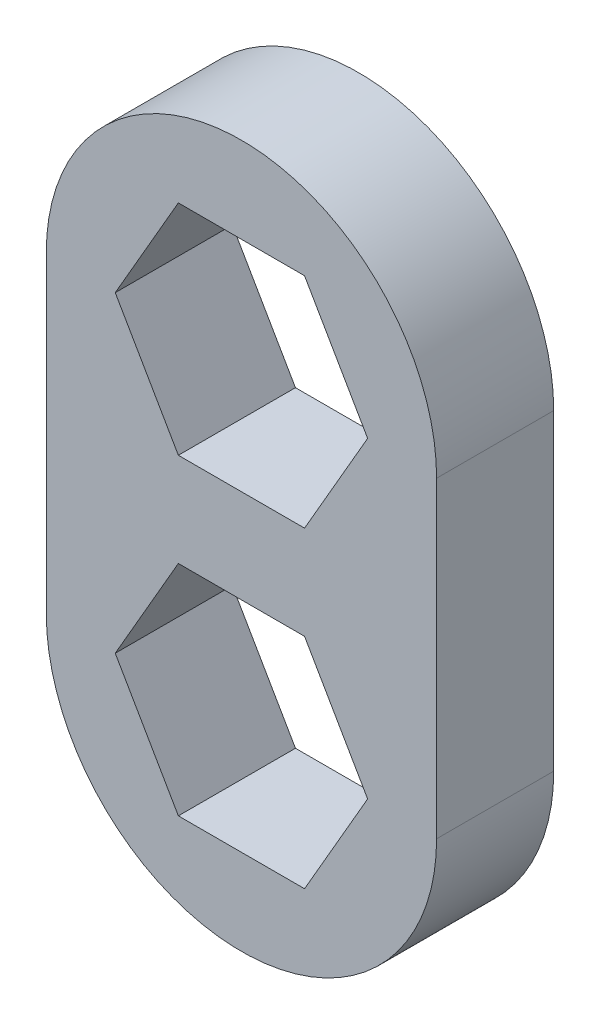
ISO-10303-21;
HEADER;
FILE_DESCRIPTION(('STEP AP214'),'2;1');
FILE_NAME('part.step','',(''),(''),'','','');
FILE_SCHEMA(('AUTOMOTIVE_DESIGN { 1 0 10303 214 1 1 1 1 }'));
ENDSEC;
DATA;
#1=APPLICATION_CONTEXT('core data for automotive mechanical design processes');
#2=APPLICATION_PROTOCOL_DEFINITION('international standard','automotive_design',2000,#1);
#3=PRODUCT_CONTEXT('',#1,'mechanical');
#4=PRODUCT('Part','Part','',(#3));
#5=PRODUCT_RELATED_PRODUCT_CATEGORY('part','',(#4));
#6=PRODUCT_DEFINITION_FORMATION('','',#4);
#7=PRODUCT_DEFINITION_CONTEXT('part definition',#1,'design');
#8=PRODUCT_DEFINITION('design','',#6,#7);
#9=PRODUCT_DEFINITION_SHAPE('','',#8);
#10=(LENGTH_UNIT() NAMED_UNIT(*) SI_UNIT(.MILLI.,.METRE.));
#11=(NAMED_UNIT(*) PLANE_ANGLE_UNIT() SI_UNIT($,.RADIAN.));
#12=(NAMED_UNIT(*) SI_UNIT($,.STERADIAN.) SOLID_ANGLE_UNIT());
#13=UNCERTAINTY_MEASURE_WITH_UNIT(LENGTH_MEASURE(1.E-05),#10,'distance_accuracy_value','');
#14=(GEOMETRIC_REPRESENTATION_CONTEXT(3) GLOBAL_UNCERTAINTY_ASSIGNED_CONTEXT((#13)) GLOBAL_UNIT_ASSIGNED_CONTEXT((#10,
#11,#12)) REPRESENTATION_CONTEXT('',''));
#15=CARTESIAN_POINT('',(0.,0.,0.));
#16=DIRECTION('',(0.,0.,1.));
#17=DIRECTION('',(1.,0.,0.));
#18=AXIS2_PLACEMENT_3D('',#15,#16,#17);
#19=CARTESIAN_POINT('',(0.,-4.,3.));
#20=DIRECTION('',(0.,0.,-1.));
#21=DIRECTION('',(-1.,0.,0.));
#22=AXIS2_PLACEMENT_3D('',#19,#20,#21);
#23=PLANE('',#22);
#24=DIRECTION('',(1.,0.,0.));
#25=VECTOR('',#24,1.);
#26=CARTESIAN_POINT('',(-1.61658075373095,1.2,3.));
#27=LINE('',#26,#25);
#28=CARTESIAN_POINT('',(-1.61658075373095,1.2,3.));
#29=VERTEX_POINT('',#28);
#30=CARTESIAN_POINT('',(1.61658075373095,1.2,3.));
#31=VERTEX_POINT('',#30);
#32=EDGE_CURVE('E226',#29,#31,#27,.T.);
#33=ORIENTED_EDGE('',*,*,#32,.F.);
#34=DIRECTION('',(0.5,-0.866025403784439,0.));
#35=VECTOR('',#34,1.);
#36=CARTESIAN_POINT('',(-3.2331615074619,4.,3.));
#37=LINE('',#36,#35);
#38=CARTESIAN_POINT('',(-3.2331615074619,4.,3.));
#39=VERTEX_POINT('',#38);
#40=EDGE_CURVE('E243',#39,#29,#37,.T.);
#41=ORIENTED_EDGE('',*,*,#40,.F.);
#42=DIRECTION('',(-0.5,-0.866025403784439,0.));
#43=VECTOR('',#42,1.);
#44=CARTESIAN_POINT('',(-1.61658075373095,6.8,3.));
#45=LINE('',#44,#43);
#46=CARTESIAN_POINT('',(-1.61658075373095,6.8,3.));
#47=VERTEX_POINT('',#46);
#48=EDGE_CURVE('E239',#47,#39,#45,.T.);
#49=ORIENTED_EDGE('',*,*,#48,.F.);
#50=DIRECTION('',(-1.,0.,0.));
#51=VECTOR('',#50,1.);
#52=CARTESIAN_POINT('',(1.61658075373095,6.8,3.));
#53=LINE('',#52,#51);
#54=CARTESIAN_POINT('',(1.61658075373095,6.8,3.));
#55=VERTEX_POINT('',#54);
#56=EDGE_CURVE('E236',#55,#47,#53,.T.);
#57=ORIENTED_EDGE('',*,*,#56,.F.);
#58=DIRECTION('',(-0.5,0.866025403784439,0.));
#59=VECTOR('',#58,1.);
#60=CARTESIAN_POINT('',(3.2331615074619,4.,3.));
#61=LINE('',#60,#59);
#62=CARTESIAN_POINT('',(3.2331615074619,4.,3.));
#63=VERTEX_POINT('',#62);
#64=EDGE_CURVE('E233',#63,#55,#61,.T.);
#65=ORIENTED_EDGE('',*,*,#64,.F.);
#66=DIRECTION('',(0.5,0.866025403784439,0.));
#67=VECTOR('',#66,1.);
#68=CARTESIAN_POINT('',(1.61658075373095,1.2,3.));
#69=LINE('',#68,#67);
#70=EDGE_CURVE('E229',#31,#63,#69,.T.);
#71=ORIENTED_EDGE('',*,*,#70,.F.);
#72=EDGE_LOOP('',(#33,#41,#49,#57,#65,#71));
#73=FACE_BOUND('',#72,.T.);
#74=CARTESIAN_POINT('',(0.,-4.,3.));
#75=DIRECTION('',(0.,0.,1.));
#76=DIRECTION('',(-1.,0.,0.));
#77=AXIS2_PLACEMENT_3D('',#74,#75,#76);
#78=CIRCLE('',#77,5.);
#79=CARTESIAN_POINT('',(-5.,-4.,3.));
#80=VERTEX_POINT('',#79);
#81=CARTESIAN_POINT('',(5.,-4.,3.));
#82=VERTEX_POINT('',#81);
#83=EDGE_CURVE('E289',#80,#82,#78,.T.);
#84=ORIENTED_EDGE('',*,*,#83,.T.);
#85=DIRECTION('',(0.,1.,0.));
#86=VECTOR('',#85,1.);
#87=CARTESIAN_POINT('',(5.,4.,3.));
#88=LINE('',#87,#86);
#89=CARTESIAN_POINT('',(5.,4.,3.));
#90=VERTEX_POINT('',#89);
#91=EDGE_CURVE('E293',#82,#90,#88,.T.);
#92=ORIENTED_EDGE('',*,*,#91,.T.);
#93=CARTESIAN_POINT('',(0.,4.,3.));
#94=DIRECTION('',(0.,0.,1.));
#95=DIRECTION('',(-1.,0.,0.));
#96=AXIS2_PLACEMENT_3D('',#93,#94,#95);
#97=CIRCLE('',#96,5.);
#98=CARTESIAN_POINT('',(-5.,4.,3.));
#99=VERTEX_POINT('',#98);
#100=EDGE_CURVE('E297',#90,#99,#97,.T.);
#101=ORIENTED_EDGE('',*,*,#100,.T.);
#102=DIRECTION('',(0.,-1.,0.));
#103=VECTOR('',#102,1.);
#104=CARTESIAN_POINT('',(-5.,-4.,3.));
#105=LINE('',#104,#103);
#106=EDGE_CURVE('E300',#99,#80,#105,.T.);
#107=ORIENTED_EDGE('',*,*,#106,.T.);
#108=EDGE_LOOP('',(#84,#92,#101,#107));
#109=FACE_BOUND('',#108,.T.);
#110=DIRECTION('',(0.5,0.866025403784439,0.));
#111=VECTOR('',#110,1.);
#112=CARTESIAN_POINT('',(1.61658075373095,-6.8,3.));
#113=LINE('',#112,#111);
#114=CARTESIAN_POINT('',(1.61658075373095,-6.8,3.));
#115=VERTEX_POINT('',#114);
#116=CARTESIAN_POINT('',(3.2331615074619,-4.,3.));
#117=VERTEX_POINT('',#116);
#118=EDGE_CURVE('E157',#115,#117,#113,.T.);
#119=ORIENTED_EDGE('',*,*,#118,.F.);
#120=DIRECTION('',(1.,0.,0.));
#121=VECTOR('',#120,1.);
#122=CARTESIAN_POINT('',(-1.61658075373095,-6.8,3.));
#123=LINE('',#122,#121);
#124=CARTESIAN_POINT('',(-1.61658075373095,-6.8,3.));
#125=VERTEX_POINT('',#124);
#126=EDGE_CURVE('E192',#125,#115,#123,.T.);
#127=ORIENTED_EDGE('',*,*,#126,.F.);
#128=DIRECTION('',(0.5,-0.866025403784438,0.));
#129=VECTOR('',#128,1.);
#130=CARTESIAN_POINT('',(-3.2331615074619,-4.,3.));
#131=LINE('',#130,#129);
#132=CARTESIAN_POINT('',(-3.2331615074619,-4.,3.));
#133=VERTEX_POINT('',#132);
#134=EDGE_CURVE('E189',#133,#125,#131,.T.);
#135=ORIENTED_EDGE('',*,*,#134,.F.);
#136=DIRECTION('',(-0.5,-0.866025403784439,0.));
#137=VECTOR('',#136,1.);
#138=CARTESIAN_POINT('',(-1.61658075373095,-1.20000000000001,3.));
#139=LINE('',#138,#137);
#140=CARTESIAN_POINT('',(-1.61658075373095,-1.20000000000001,3.));
#141=VERTEX_POINT('',#140);
#142=EDGE_CURVE('E184',#141,#133,#139,.T.);
#143=ORIENTED_EDGE('',*,*,#142,.F.);
#144=DIRECTION('',(-1.,0.,0.));
#145=VECTOR('',#144,1.);
#146=CARTESIAN_POINT('',(1.61658075373095,-1.2,3.));
#147=LINE('',#146,#145);
#148=CARTESIAN_POINT('',(1.61658075373095,-1.2,3.));
#149=VERTEX_POINT('',#148);
#150=EDGE_CURVE('E180',#149,#141,#147,.T.);
#151=ORIENTED_EDGE('',*,*,#150,.F.);
#152=DIRECTION('',(-0.499999999999999,0.866025403784439,0.));
#153=VECTOR('',#152,1.);
#154=CARTESIAN_POINT('',(3.2331615074619,-4.,3.));
#155=LINE('',#154,#153);
#156=EDGE_CURVE('E166',#117,#149,#155,.T.);
#157=ORIENTED_EDGE('',*,*,#156,.F.);
#158=EDGE_LOOP('',(#119,#127,#135,#143,#151,#157));
#159=FACE_BOUND('',#158,.T.);
#160=ADVANCED_FACE('F43',(#73,#109,#159),#23,.F.);
#161=CARTESIAN_POINT('',(0.,-4.,0.));
#162=DIRECTION('',(0.,0.,-1.));
#163=DIRECTION('',(-1.,0.,0.));
#164=AXIS2_PLACEMENT_3D('',#161,#162,#163);
#165=PLANE('',#164);
#166=CARTESIAN_POINT('',(0.,-4.,0.));
#167=DIRECTION('',(0.,0.,1.));
#168=DIRECTION('',(-1.,0.,0.));
#169=AXIS2_PLACEMENT_3D('',#166,#167,#168);
#170=CIRCLE('',#169,5.);
#171=CARTESIAN_POINT('',(-5.,-4.,0.));
#172=VERTEX_POINT('',#171);
#173=CARTESIAN_POINT('',(5.,-4.,0.));
#174=VERTEX_POINT('',#173);
#175=EDGE_CURVE('E288',#172,#174,#170,.T.);
#176=ORIENTED_EDGE('',*,*,#175,.F.);
#177=DIRECTION('',(0.,-1.,0.));
#178=VECTOR('',#177,1.);
#179=CARTESIAN_POINT('',(-5.,-4.,0.));
#180=LINE('',#179,#178);
#181=CARTESIAN_POINT('',(-5.,4.,0.));
#182=VERTEX_POINT('',#181);
#183=EDGE_CURVE('E294',#182,#172,#180,.T.);
#184=ORIENTED_EDGE('',*,*,#183,.F.);
#185=CARTESIAN_POINT('',(0.,4.,0.));
#186=DIRECTION('',(0.,0.,1.));
#187=DIRECTION('',(-1.,0.,0.));
#188=AXIS2_PLACEMENT_3D('',#185,#186,#187);
#189=CIRCLE('',#188,5.);
#190=CARTESIAN_POINT('',(5.,4.,0.));
#191=VERTEX_POINT('',#190);
#192=EDGE_CURVE('E310',#191,#182,#189,.T.);
#193=ORIENTED_EDGE('',*,*,#192,.F.);
#194=DIRECTION('',(0.,1.,0.));
#195=VECTOR('',#194,1.);
#196=CARTESIAN_POINT('',(5.,4.,0.));
#197=LINE('',#196,#195);
#198=EDGE_CURVE('E307',#174,#191,#197,.T.);
#199=ORIENTED_EDGE('',*,*,#198,.F.);
#200=EDGE_LOOP('',(#176,#184,#193,#199));
#201=FACE_BOUND('',#200,.T.);
#202=DIRECTION('',(0.5,-0.866025403784439,0.));
#203=VECTOR('',#202,1.);
#204=CARTESIAN_POINT('',(-3.2331615074619,4.,0.));
#205=LINE('',#204,#203);
#206=CARTESIAN_POINT('',(-3.2331615074619,4.,0.));
#207=VERTEX_POINT('',#206);
#208=CARTESIAN_POINT('',(-1.61658075373095,1.2,0.));
#209=VERTEX_POINT('',#208);
#210=EDGE_CURVE('E230',#207,#209,#205,.T.);
#211=ORIENTED_EDGE('',*,*,#210,.T.);
#212=DIRECTION('',(1.,0.,0.));
#213=VECTOR('',#212,1.);
#214=CARTESIAN_POINT('',(-1.61658075373095,1.2,0.));
#215=LINE('',#214,#213);
#216=CARTESIAN_POINT('',(1.61658075373095,1.2,0.));
#217=VERTEX_POINT('',#216);
#218=EDGE_CURVE('E175',#209,#217,#215,.T.);
#219=ORIENTED_EDGE('',*,*,#218,.T.);
#220=DIRECTION('',(0.5,0.866025403784439,0.));
#221=VECTOR('',#220,1.);
#222=CARTESIAN_POINT('',(1.61658075373095,1.2,0.));
#223=LINE('',#222,#221);
#224=CARTESIAN_POINT('',(3.2331615074619,4.,0.));
#225=VERTEX_POINT('',#224);
#226=EDGE_CURVE('E250',#217,#225,#223,.T.);
#227=ORIENTED_EDGE('',*,*,#226,.T.);
#228=DIRECTION('',(-0.5,0.866025403784439,0.));
#229=VECTOR('',#228,1.);
#230=CARTESIAN_POINT('',(3.2331615074619,4.,0.));
#231=LINE('',#230,#229);
#232=CARTESIAN_POINT('',(1.61658075373095,6.8,0.));
#233=VERTEX_POINT('',#232);
#234=EDGE_CURVE('E254',#225,#233,#231,.T.);
#235=ORIENTED_EDGE('',*,*,#234,.T.);
#236=DIRECTION('',(-1.,0.,0.));
#237=VECTOR('',#236,1.);
#238=CARTESIAN_POINT('',(1.61658075373095,6.8,0.));
#239=LINE('',#238,#237);
#240=CARTESIAN_POINT('',(-1.61658075373095,6.8,0.));
#241=VERTEX_POINT('',#240);
#242=EDGE_CURVE('E258',#233,#241,#239,.T.);
#243=ORIENTED_EDGE('',*,*,#242,.T.);
#244=DIRECTION('',(-0.5,-0.866025403784439,0.));
#245=VECTOR('',#244,1.);
#246=CARTESIAN_POINT('',(-1.61658075373095,6.8,0.));
#247=LINE('',#246,#245);
#248=EDGE_CURVE('E262',#241,#207,#247,.T.);
#249=ORIENTED_EDGE('',*,*,#248,.T.);
#250=EDGE_LOOP('',(#211,#219,#227,#235,#243,#249));
#251=FACE_BOUND('',#250,.T.);
#252=DIRECTION('',(1.,0.,0.));
#253=VECTOR('',#252,1.);
#254=CARTESIAN_POINT('',(-1.61658075373095,-6.8,0.));
#255=LINE('',#254,#253);
#256=CARTESIAN_POINT('',(-1.61658075373095,-6.8,0.));
#257=VERTEX_POINT('',#256);
#258=CARTESIAN_POINT('',(1.61658075373095,-6.8,0.));
#259=VERTEX_POINT('',#258);
#260=EDGE_CURVE('E167',#257,#259,#255,.T.);
#261=ORIENTED_EDGE('',*,*,#260,.T.);
#262=DIRECTION('',(0.5,0.866025403784439,0.));
#263=VECTOR('',#262,1.);
#264=CARTESIAN_POINT('',(1.61658075373095,-6.8,0.));
#265=LINE('',#264,#263);
#266=CARTESIAN_POINT('',(3.2331615074619,-4.,0.));
#267=VERTEX_POINT('',#266);
#268=EDGE_CURVE('E67',#259,#267,#265,.T.);
#269=ORIENTED_EDGE('',*,*,#268,.T.);
#270=DIRECTION('',(-0.499999999999999,0.866025403784439,0.));
#271=VECTOR('',#270,1.);
#272=CARTESIAN_POINT('',(3.2331615074619,-4.,0.));
#273=LINE('',#272,#271);
#274=CARTESIAN_POINT('',(1.61658075373095,-1.2,0.));
#275=VERTEX_POINT('',#274);
#276=EDGE_CURVE('E173',#267,#275,#273,.T.);
#277=ORIENTED_EDGE('',*,*,#276,.T.);
#278=DIRECTION('',(-1.,0.,0.));
#279=VECTOR('',#278,1.);
#280=CARTESIAN_POINT('',(1.61658075373095,-1.2,0.));
#281=LINE('',#280,#279);
#282=CARTESIAN_POINT('',(-1.61658075373095,-1.20000000000001,0.));
#283=VERTEX_POINT('',#282);
#284=EDGE_CURVE('E199',#275,#283,#281,.T.);
#285=ORIENTED_EDGE('',*,*,#284,.T.);
#286=DIRECTION('',(-0.5,-0.866025403784439,0.));
#287=VECTOR('',#286,1.);
#288=CARTESIAN_POINT('',(-1.61658075373095,-1.20000000000001,0.));
#289=LINE('',#288,#287);
#290=CARTESIAN_POINT('',(-3.2331615074619,-4.,0.));
#291=VERTEX_POINT('',#290);
#292=EDGE_CURVE('E203',#283,#291,#289,.T.);
#293=ORIENTED_EDGE('',*,*,#292,.T.);
#294=DIRECTION('',(0.5,-0.866025403784438,0.));
#295=VECTOR('',#294,1.);
#296=CARTESIAN_POINT('',(-3.2331615074619,-4.,0.));
#297=LINE('',#296,#295);
#298=EDGE_CURVE('E207',#291,#257,#297,.T.);
#299=ORIENTED_EDGE('',*,*,#298,.T.);
#300=EDGE_LOOP('',(#261,#269,#277,#285,#293,#299));
#301=FACE_BOUND('',#300,.T.);
#302=ADVANCED_FACE('F333',(#201,#251,#301),#165,.T.);
#303=CARTESIAN_POINT('',(0.,-4.,3.));
#304=DIRECTION('',(0.,0.,-1.));
#305=DIRECTION('',(-1.,0.,0.));
#306=AXIS2_PLACEMENT_3D('',#303,#304,#305);
#307=CYLINDRICAL_SURFACE('',#306,5.);
#308=ORIENTED_EDGE('',*,*,#175,.T.);
#309=DIRECTION('',(0.,0.,-1.));
#310=VECTOR('',#309,1.);
#311=CARTESIAN_POINT('',(5.,-4.,3.));
#312=LINE('',#311,#310);
#313=EDGE_CURVE('E11',#82,#174,#312,.T.);
#314=ORIENTED_EDGE('',*,*,#313,.F.);
#315=ORIENTED_EDGE('',*,*,#83,.F.);
#316=DIRECTION('',(0.,0.,-1.));
#317=VECTOR('',#316,1.);
#318=CARTESIAN_POINT('',(-5.,-4.,3.));
#319=LINE('',#318,#317);
#320=EDGE_CURVE('E303',#80,#172,#319,.T.);
#321=ORIENTED_EDGE('',*,*,#320,.T.);
#322=EDGE_LOOP('',(#308,#314,#315,#321));
#323=FACE_BOUND('',#322,.T.);
#324=ADVANCED_FACE('F45',(#323),#307,.T.);
#325=CARTESIAN_POINT('',(5.,4.,3.));
#326=DIRECTION('',(-1.,0.,0.));
#327=DIRECTION('',(0.,0.,1.));
#328=AXIS2_PLACEMENT_3D('',#325,#326,#327);
#329=PLANE('',#328);
#330=ORIENTED_EDGE('',*,*,#198,.T.);
#331=DIRECTION('',(0.,0.,-1.));
#332=VECTOR('',#331,1.);
#333=CARTESIAN_POINT('',(5.,4.,3.));
#334=LINE('',#333,#332);
#335=EDGE_CURVE('E52',#90,#191,#334,.T.);
#336=ORIENTED_EDGE('',*,*,#335,.F.);
#337=ORIENTED_EDGE('',*,*,#91,.F.);
#338=ORIENTED_EDGE('',*,*,#313,.T.);
#339=EDGE_LOOP('',(#330,#336,#337,#338));
#340=FACE_BOUND('',#339,.T.);
#341=ADVANCED_FACE('F343',(#340),#329,.F.);
#342=CARTESIAN_POINT('',(0.,4.,3.));
#343=DIRECTION('',(0.,0.,-1.));
#344=DIRECTION('',(-1.,0.,0.));
#345=AXIS2_PLACEMENT_3D('',#342,#343,#344);
#346=CYLINDRICAL_SURFACE('',#345,5.);
#347=ORIENTED_EDGE('',*,*,#192,.T.);
#348=DIRECTION('',(0.,0.,-1.));
#349=VECTOR('',#348,1.);
#350=CARTESIAN_POINT('',(-5.,4.,3.));
#351=LINE('',#350,#349);
#352=EDGE_CURVE('E318',#99,#182,#351,.T.);
#353=ORIENTED_EDGE('',*,*,#352,.F.);
#354=ORIENTED_EDGE('',*,*,#100,.F.);
#355=ORIENTED_EDGE('',*,*,#335,.T.);
#356=EDGE_LOOP('',(#347,#353,#354,#355));
#357=FACE_BOUND('',#356,.T.);
#358=ADVANCED_FACE('F327',(#357),#346,.T.);
#359=CARTESIAN_POINT('',(-5.,-4.,3.));
#360=DIRECTION('',(1.,0.,0.));
#361=DIRECTION('',(0.,0.,-1.));
#362=AXIS2_PLACEMENT_3D('',#359,#360,#361);
#363=PLANE('',#362);
#364=ORIENTED_EDGE('',*,*,#183,.T.);
#365=ORIENTED_EDGE('',*,*,#320,.F.);
#366=ORIENTED_EDGE('',*,*,#106,.F.);
#367=ORIENTED_EDGE('',*,*,#352,.T.);
#368=EDGE_LOOP('',(#364,#365,#366,#367));
#369=FACE_BOUND('',#368,.T.);
#370=ADVANCED_FACE('F337',(#369),#363,.F.);
#371=CARTESIAN_POINT('',(-1.61658075373095,1.2,3.));
#372=DIRECTION('',(0.,1.,0.));
#373=DIRECTION('',(0.,0.,1.));
#374=AXIS2_PLACEMENT_3D('',#371,#372,#373);
#375=PLANE('',#374);
#376=ORIENTED_EDGE('',*,*,#218,.F.);
#377=DIRECTION('',(0.,0.,-1.));
#378=VECTOR('',#377,1.);
#379=CARTESIAN_POINT('',(-1.61658075373095,1.2,3.));
#380=LINE('',#379,#378);
#381=EDGE_CURVE('E246',#29,#209,#380,.T.);
#382=ORIENTED_EDGE('',*,*,#381,.F.);
#383=ORIENTED_EDGE('',*,*,#32,.T.);
#384=DIRECTION('',(0.,0.,-1.));
#385=VECTOR('',#384,1.);
#386=CARTESIAN_POINT('',(1.61658075373095,1.2,3.));
#387=LINE('',#386,#385);
#388=EDGE_CURVE('E284',#31,#217,#387,.T.);
#389=ORIENTED_EDGE('',*,*,#388,.T.);
#390=EDGE_LOOP('',(#376,#382,#383,#389));
#391=FACE_BOUND('',#390,.T.);
#392=ADVANCED_FACE('F359',(#391),#375,.T.);
#393=CARTESIAN_POINT('',(1.61658075373095,1.2,3.));
#394=DIRECTION('',(-0.866025403784439,0.5,0.));
#395=DIRECTION('',(-0.5,-0.866025403784439,0.));
#396=AXIS2_PLACEMENT_3D('',#393,#394,#395);
#397=PLANE('',#396);
#398=ORIENTED_EDGE('',*,*,#226,.F.);
#399=ORIENTED_EDGE('',*,*,#388,.F.);
#400=ORIENTED_EDGE('',*,*,#70,.T.);
#401=DIRECTION('',(0.,0.,-1.));
#402=VECTOR('',#401,1.);
#403=CARTESIAN_POINT('',(3.2331615074619,4.,3.));
#404=LINE('',#403,#402);
#405=EDGE_CURVE('E281',#63,#225,#404,.T.);
#406=ORIENTED_EDGE('',*,*,#405,.T.);
#407=EDGE_LOOP('',(#398,#399,#400,#406));
#408=FACE_BOUND('',#407,.T.);
#409=ADVANCED_FACE('F366',(#408),#397,.T.);
#410=CARTESIAN_POINT('',(3.2331615074619,4.,3.));
#411=DIRECTION('',(-0.866025403784439,-0.5,0.));
#412=DIRECTION('',(0.5,-0.866025403784439,0.));
#413=AXIS2_PLACEMENT_3D('',#410,#411,#412);
#414=PLANE('',#413);
#415=ORIENTED_EDGE('',*,*,#234,.F.);
#416=ORIENTED_EDGE('',*,*,#405,.F.);
#417=ORIENTED_EDGE('',*,*,#64,.T.);
#418=DIRECTION('',(0.,0.,-1.));
#419=VECTOR('',#418,1.);
#420=CARTESIAN_POINT('',(1.61658075373095,6.8,3.));
#421=LINE('',#420,#419);
#422=EDGE_CURVE('E278',#55,#233,#421,.T.);
#423=ORIENTED_EDGE('',*,*,#422,.T.);
#424=EDGE_LOOP('',(#415,#416,#417,#423));
#425=FACE_BOUND('',#424,.T.);
#426=ADVANCED_FACE('F371',(#425),#414,.T.);
#427=CARTESIAN_POINT('',(1.61658075373095,6.8,3.));
#428=DIRECTION('',(0.,-1.,0.));
#429=DIRECTION('',(0.,0.,-1.));
#430=AXIS2_PLACEMENT_3D('',#427,#428,#429);
#431=PLANE('',#430);
#432=ORIENTED_EDGE('',*,*,#242,.F.);
#433=ORIENTED_EDGE('',*,*,#422,.F.);
#434=ORIENTED_EDGE('',*,*,#56,.T.);
#435=DIRECTION('',(0.,0.,-1.));
#436=VECTOR('',#435,1.);
#437=CARTESIAN_POINT('',(-1.61658075373095,6.8,3.));
#438=LINE('',#437,#436);
#439=EDGE_CURVE('E275',#47,#241,#438,.T.);
#440=ORIENTED_EDGE('',*,*,#439,.T.);
#441=EDGE_LOOP('',(#432,#433,#434,#440));
#442=FACE_BOUND('',#441,.T.);
#443=ADVANCED_FACE('F394',(#442),#431,.T.);
#444=CARTESIAN_POINT('',(-1.61658075373095,6.8,3.));
#445=DIRECTION('',(0.866025403784439,-0.5,0.));
#446=DIRECTION('',(0.5,0.866025403784439,0.));
#447=AXIS2_PLACEMENT_3D('',#444,#445,#446);
#448=PLANE('',#447);
#449=ORIENTED_EDGE('',*,*,#248,.F.);
#450=ORIENTED_EDGE('',*,*,#439,.F.);
#451=ORIENTED_EDGE('',*,*,#48,.T.);
#452=DIRECTION('',(0.,0.,-1.));
#453=VECTOR('',#452,1.);
#454=CARTESIAN_POINT('',(-3.2331615074619,4.,3.));
#455=LINE('',#454,#453);
#456=EDGE_CURVE('E272',#39,#207,#455,.T.);
#457=ORIENTED_EDGE('',*,*,#456,.T.);
#458=EDGE_LOOP('',(#449,#450,#451,#457));
#459=FACE_BOUND('',#458,.T.);
#460=ADVANCED_FACE('F384',(#459),#448,.T.);
#461=CARTESIAN_POINT('',(-3.2331615074619,4.,3.));
#462=DIRECTION('',(0.866025403784439,0.5,0.));
#463=DIRECTION('',(-0.5,0.866025403784439,0.));
#464=AXIS2_PLACEMENT_3D('',#461,#462,#463);
#465=PLANE('',#464);
#466=ORIENTED_EDGE('',*,*,#210,.F.);
#467=ORIENTED_EDGE('',*,*,#456,.F.);
#468=ORIENTED_EDGE('',*,*,#40,.T.);
#469=ORIENTED_EDGE('',*,*,#381,.T.);
#470=EDGE_LOOP('',(#466,#467,#468,#469));
#471=FACE_BOUND('',#470,.T.);
#472=ADVANCED_FACE('F377',(#471),#465,.T.);
#473=CARTESIAN_POINT('',(1.61658075373095,-6.8,3.));
#474=DIRECTION('',(-0.866025403784439,0.499999999999999,0.));
#475=DIRECTION('',(-0.5,-0.866025403784439,0.));
#476=AXIS2_PLACEMENT_3D('',#473,#474,#475);
#477=PLANE('',#476);
#478=ORIENTED_EDGE('',*,*,#268,.F.);
#479=DIRECTION('',(0.,0.,-1.));
#480=VECTOR('',#479,1.);
#481=CARTESIAN_POINT('',(1.61658075373095,-6.8,3.));
#482=LINE('',#481,#480);
#483=EDGE_CURVE('E161',#115,#259,#482,.T.);
#484=ORIENTED_EDGE('',*,*,#483,.F.);
#485=ORIENTED_EDGE('',*,*,#118,.T.);
#486=DIRECTION('',(0.,0.,-1.));
#487=VECTOR('',#486,1.);
#488=CARTESIAN_POINT('',(3.2331615074619,-4.,3.));
#489=LINE('',#488,#487);
#490=EDGE_CURVE('E160',#117,#267,#489,.T.);
#491=ORIENTED_EDGE('',*,*,#490,.T.);
#492=EDGE_LOOP('',(#478,#484,#485,#491));
#493=FACE_BOUND('',#492,.T.);
#494=ADVANCED_FACE('F159',(#493),#477,.T.);
#495=CARTESIAN_POINT('',(3.2331615074619,-4.,3.));
#496=DIRECTION('',(-0.866025403784439,-0.499999999999999,0.));
#497=DIRECTION('',(0.499999999999999,-0.866025403784439,0.));
#498=AXIS2_PLACEMENT_3D('',#495,#496,#497);
#499=PLANE('',#498);
#500=ORIENTED_EDGE('',*,*,#276,.F.);
#501=ORIENTED_EDGE('',*,*,#490,.F.);
#502=ORIENTED_EDGE('',*,*,#156,.T.);
#503=DIRECTION('',(0.,0.,-1.));
#504=VECTOR('',#503,1.);
#505=CARTESIAN_POINT('',(1.61658075373095,-1.2,3.));
#506=LINE('',#505,#504);
#507=EDGE_CURVE('E176',#149,#275,#506,.T.);
#508=ORIENTED_EDGE('',*,*,#507,.T.);
#509=EDGE_LOOP('',(#500,#501,#502,#508));
#510=FACE_BOUND('',#509,.T.);
#511=ADVANCED_FACE('F170',(#510),#499,.T.);
#512=CARTESIAN_POINT('',(1.61658075373095,-1.2,3.));
#513=DIRECTION('',(0.,-1.,0.));
#514=DIRECTION('',(1.,0.,0.));
#515=AXIS2_PLACEMENT_3D('',#512,#513,#514);
#516=PLANE('',#515);
#517=ORIENTED_EDGE('',*,*,#284,.F.);
#518=ORIENTED_EDGE('',*,*,#507,.F.);
#519=ORIENTED_EDGE('',*,*,#150,.T.);
#520=DIRECTION('',(0.,0.,-1.));
#521=VECTOR('',#520,1.);
#522=CARTESIAN_POINT('',(-1.61658075373095,-1.20000000000001,3.));
#523=LINE('',#522,#521);
#524=EDGE_CURVE('E221',#141,#283,#523,.T.);
#525=ORIENTED_EDGE('',*,*,#524,.T.);
#526=EDGE_LOOP('',(#517,#518,#519,#525));
#527=FACE_BOUND('',#526,.T.);
#528=ADVANCED_FACE('F410',(#527),#516,.T.);
#529=CARTESIAN_POINT('',(-1.61658075373095,-1.20000000000001,3.));
#530=DIRECTION('',(0.866025403784439,-0.5,0.));
#531=DIRECTION('',(0.5,0.866025403784439,0.));
#532=AXIS2_PLACEMENT_3D('',#529,#530,#531);
#533=PLANE('',#532);
#534=ORIENTED_EDGE('',*,*,#292,.F.);
#535=ORIENTED_EDGE('',*,*,#524,.F.);
#536=ORIENTED_EDGE('',*,*,#142,.T.);
#537=DIRECTION('',(0.,0.,-1.));
#538=VECTOR('',#537,1.);
#539=CARTESIAN_POINT('',(-3.2331615074619,-4.,3.));
#540=LINE('',#539,#538);
#541=EDGE_CURVE('E218',#133,#291,#540,.T.);
#542=ORIENTED_EDGE('',*,*,#541,.T.);
#543=EDGE_LOOP('',(#534,#535,#536,#542));
#544=FACE_BOUND('',#543,.T.);
#545=ADVANCED_FACE('F413',(#544),#533,.T.);
#546=CARTESIAN_POINT('',(-3.2331615074619,-4.,3.));
#547=DIRECTION('',(0.866025403784438,0.5,0.));
#548=DIRECTION('',(-0.5,0.866025403784438,0.));
#549=AXIS2_PLACEMENT_3D('',#546,#547,#548);
#550=PLANE('',#549);
#551=ORIENTED_EDGE('',*,*,#298,.F.);
#552=ORIENTED_EDGE('',*,*,#541,.F.);
#553=ORIENTED_EDGE('',*,*,#134,.T.);
#554=DIRECTION('',(0.,0.,-1.));
#555=VECTOR('',#554,1.);
#556=CARTESIAN_POINT('',(-1.61658075373095,-6.8,3.));
#557=LINE('',#556,#555);
#558=EDGE_CURVE('E59',#125,#257,#557,.T.);
#559=ORIENTED_EDGE('',*,*,#558,.T.);
#560=EDGE_LOOP('',(#551,#552,#553,#559));
#561=FACE_BOUND('',#560,.T.);
#562=ADVANCED_FACE('F417',(#561),#550,.T.);
#563=CARTESIAN_POINT('',(-1.61658075373095,-6.8,3.));
#564=DIRECTION('',(0.,1.,0.));
#565=DIRECTION('',(-1.,0.,0.));
#566=AXIS2_PLACEMENT_3D('',#563,#564,#565);
#567=PLANE('',#566);
#568=ORIENTED_EDGE('',*,*,#260,.F.);
#569=ORIENTED_EDGE('',*,*,#558,.F.);
#570=ORIENTED_EDGE('',*,*,#126,.T.);
#571=ORIENTED_EDGE('',*,*,#483,.T.);
#572=EDGE_LOOP('',(#568,#569,#570,#571));
#573=FACE_BOUND('',#572,.T.);
#574=ADVANCED_FACE('F421',(#573),#567,.T.);
#575=CLOSED_SHELL('',(#160,#302,#324,#341,#358,#370,#392,#409,#426,#443,#460,#472,#494,#511,
#528,#545,#562,#574));
#576=MANIFOLD_SOLID_BREP('B2',#575);
#577=ADVANCED_BREP_SHAPE_REPRESENTATION('',(#18,#576),#14);
#578=SHAPE_DEFINITION_REPRESENTATION(#9,#577);
ENDSEC;
END-ISO-10303-21;
